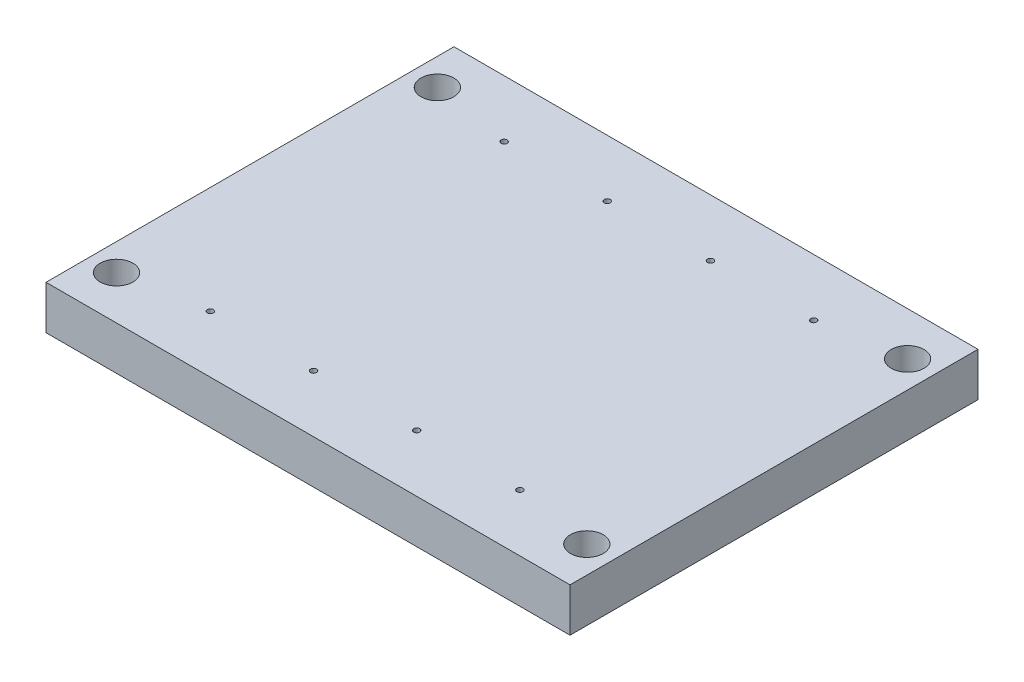
ISO-10303-21;
HEADER;
FILE_DESCRIPTION(('STEP AP214'),'2;1');
FILE_NAME('part.step','',(''),(''),'','','');
FILE_SCHEMA(('AUTOMOTIVE_DESIGN { 1 0 10303 214 1 1 1 1 }'));
ENDSEC;
DATA;
#1=APPLICATION_CONTEXT('core data for automotive mechanical design processes');
#2=APPLICATION_PROTOCOL_DEFINITION('international standard','automotive_design',2000,#1);
#3=PRODUCT_CONTEXT('',#1,'mechanical');
#4=PRODUCT('Part','Part','',(#3));
#5=PRODUCT_RELATED_PRODUCT_CATEGORY('part','',(#4));
#6=PRODUCT_DEFINITION_FORMATION('','',#4);
#7=PRODUCT_DEFINITION_CONTEXT('part definition',#1,'design');
#8=PRODUCT_DEFINITION('design','',#6,#7);
#9=PRODUCT_DEFINITION_SHAPE('','',#8);
#10=(LENGTH_UNIT() NAMED_UNIT(*) SI_UNIT(.MILLI.,.METRE.));
#11=(NAMED_UNIT(*) PLANE_ANGLE_UNIT() SI_UNIT($,.RADIAN.));
#12=(NAMED_UNIT(*) SI_UNIT($,.STERADIAN.) SOLID_ANGLE_UNIT());
#13=UNCERTAINTY_MEASURE_WITH_UNIT(LENGTH_MEASURE(1.E-05),#10,'distance_accuracy_value','');
#14=(GEOMETRIC_REPRESENTATION_CONTEXT(3) GLOBAL_UNCERTAINTY_ASSIGNED_CONTEXT((#13)) GLOBAL_UNIT_ASSIGNED_CONTEXT((#10,
#11,#12)) REPRESENTATION_CONTEXT('',''));
#15=CARTESIAN_POINT('',(0.,0.,0.));
#16=DIRECTION('',(0.,0.,1.));
#17=DIRECTION('',(1.,0.,0.));
#18=AXIS2_PLACEMENT_3D('',#15,#16,#17);
#19=CARTESIAN_POINT('',(0.,25.3999999999998,118.64219472189));
#20=DIRECTION('',(0.,0.,1.));
#21=DIRECTION('',(1.,0.,0.));
#22=AXIS2_PLACEMENT_3D('',#19,#20,#21);
#23=PLANE('',#22);
#24=DIRECTION('',(0.,1.,0.));
#25=VECTOR('',#24,1.);
#26=CARTESIAN_POINT('',(-37.9000000000013,25.3999999999998,118.64219472189));
#27=LINE('',#26,#25);
#28=CARTESIAN_POINT('',(-37.9000000000013,0.,118.64219472189));
#29=VERTEX_POINT('',#28);
#30=CARTESIAN_POINT('',(-37.9000000000013,25.3999999999998,118.64219472189));
#31=VERTEX_POINT('',#30);
#32=EDGE_CURVE('E79',#29,#31,#27,.T.);
#33=ORIENTED_EDGE('',*,*,#32,.F.);
#34=DIRECTION('',(-1.,0.,0.));
#35=VECTOR('',#34,1.);
#36=CARTESIAN_POINT('',(0.,0.,118.64219472189));
#37=LINE('',#36,#35);
#38=CARTESIAN_POINT('',(266.899999999999,0.,118.64219472189));
#39=VERTEX_POINT('',#38);
#40=EDGE_CURVE('E90',#39,#29,#37,.T.);
#41=ORIENTED_EDGE('',*,*,#40,.F.);
#42=DIRECTION('',(0.,-1.,0.));
#43=VECTOR('',#42,1.);
#44=CARTESIAN_POINT('',(266.899999999999,25.3999999999998,118.64219472189));
#45=LINE('',#44,#43);
#46=CARTESIAN_POINT('',(266.899999999999,25.3999999999998,118.64219472189));
#47=VERTEX_POINT('',#46);
#48=EDGE_CURVE('E61',#47,#39,#45,.T.);
#49=ORIENTED_EDGE('',*,*,#48,.F.);
#50=DIRECTION('',(-1.,0.,0.));
#51=VECTOR('',#50,1.);
#52=CARTESIAN_POINT('',(0.,25.3999999999998,118.64219472189));
#53=LINE('',#52,#51);
#54=EDGE_CURVE('E45',#47,#31,#53,.T.);
#55=ORIENTED_EDGE('',*,*,#54,.T.);
#56=EDGE_LOOP('',(#33,#41,#49,#55));
#57=FACE_BOUND('',#56,.T.);
#58=ADVANCED_FACE('F37',(#57),#23,.T.);
#59=CARTESIAN_POINT('',(0.,25.3999999999998,-118.64219472189));
#60=DIRECTION('',(0.,0.,-1.));
#61=DIRECTION('',(-1.,0.,0.));
#62=AXIS2_PLACEMENT_3D('',#59,#60,#61);
#63=PLANE('',#62);
#64=DIRECTION('',(0.,1.,0.));
#65=VECTOR('',#64,1.);
#66=CARTESIAN_POINT('',(-37.9000000000013,25.3999999999998,-118.64219472189));
#67=LINE('',#66,#65);
#68=CARTESIAN_POINT('',(-37.9000000000013,0.,-118.64219472189));
#69=VERTEX_POINT('',#68);
#70=CARTESIAN_POINT('',(-37.9000000000013,25.3999999999998,-118.64219472189));
#71=VERTEX_POINT('',#70);
#72=EDGE_CURVE('E53',#69,#71,#67,.T.);
#73=ORIENTED_EDGE('',*,*,#72,.T.);
#74=DIRECTION('',(1.,0.,0.));
#75=VECTOR('',#74,1.);
#76=CARTESIAN_POINT('',(0.,25.3999999999998,-118.64219472189));
#77=LINE('',#76,#75);
#78=CARTESIAN_POINT('',(266.899999999999,25.3999999999998,-118.64219472189));
#79=VERTEX_POINT('',#78);
#80=EDGE_CURVE('E11',#71,#79,#77,.T.);
#81=ORIENTED_EDGE('',*,*,#80,.T.);
#82=DIRECTION('',(0.,-1.,0.));
#83=VECTOR('',#82,1.);
#84=CARTESIAN_POINT('',(266.899999999999,25.3999999999998,-118.64219472189));
#85=LINE('',#84,#83);
#86=CARTESIAN_POINT('',(266.899999999999,0.,-118.64219472189));
#87=VERTEX_POINT('',#86);
#88=EDGE_CURVE('E173',#79,#87,#85,.T.);
#89=ORIENTED_EDGE('',*,*,#88,.T.);
#90=DIRECTION('',(1.,0.,0.));
#91=VECTOR('',#90,1.);
#92=CARTESIAN_POINT('',(0.,0.,-118.64219472189));
#93=LINE('',#92,#91);
#94=EDGE_CURVE('E40',#69,#87,#93,.T.);
#95=ORIENTED_EDGE('',*,*,#94,.F.);
#96=EDGE_LOOP('',(#73,#81,#89,#95));
#97=FACE_BOUND('',#96,.T.);
#98=ADVANCED_FACE('F179',(#97),#63,.T.);
#99=CARTESIAN_POINT('',(0.,25.3999999999998,0.));
#100=DIRECTION('',(0.,1.,0.));
#101=DIRECTION('',(0.,0.,1.));
#102=AXIS2_PLACEMENT_3D('',#99,#100,#101);
#103=PLANE('',#102);
#104=DIRECTION('',(0.,0.,1.));
#105=VECTOR('',#104,1.);
#106=CARTESIAN_POINT('',(-37.9000000000013,25.3999999999998,-118.64319472189));
#107=LINE('',#106,#105);
#108=EDGE_CURVE('E85',#71,#31,#107,.T.);
#109=ORIENTED_EDGE('',*,*,#108,.T.);
#110=ORIENTED_EDGE('',*,*,#54,.F.);
#111=DIRECTION('',(0.,0.,1.));
#112=VECTOR('',#111,1.);
#113=CARTESIAN_POINT('',(266.899999999999,25.3999999999998,-118.64319472189));
#114=LINE('',#113,#112);
#115=EDGE_CURVE('E169',#79,#47,#114,.T.);
#116=ORIENTED_EDGE('',*,*,#115,.F.);
#117=ORIENTED_EDGE('',*,*,#80,.F.);
#118=EDGE_LOOP('',(#109,#110,#116,#117));
#119=FACE_BOUND('',#118,.T.);
#120=CARTESIAN_POINT('',(-22.2546615007676,25.3999999999998,-93.3378052781097));
#121=DIRECTION('',(0.,1.,0.));
#122=DIRECTION('',(0.,0.,1.));
#123=AXIS2_PLACEMENT_3D('',#120,#121,#122);
#124=CIRCLE('',#123,9.525);
#125=CARTESIAN_POINT('',(-22.2546615007676,25.3999999999998,-83.8128052781097));
#126=VERTEX_POINT('',#125);
#127=EDGE_CURVE('E152',#126,#126,#124,.T.);
#128=ORIENTED_EDGE('',*,*,#127,.F.);
#129=EDGE_LOOP('',(#128));
#130=FACE_BOUND('',#129,.T.);
#131=CARTESIAN_POINT('',(251.254661500759,25.3999999999998,-93.3378052781097));
#132=DIRECTION('',(0.,1.,0.));
#133=DIRECTION('',(0.,0.,1.));
#134=AXIS2_PLACEMENT_3D('',#131,#132,#133);
#135=CIRCLE('',#134,9.52500000000002);
#136=CARTESIAN_POINT('',(251.254661500759,25.3999999999998,-83.8128052781097));
#137=VERTEX_POINT('',#136);
#138=EDGE_CURVE('E158',#137,#137,#135,.T.);
#139=ORIENTED_EDGE('',*,*,#138,.F.);
#140=EDGE_LOOP('',(#139));
#141=FACE_BOUND('',#140,.T.);
#142=CARTESIAN_POINT('',(251.254661500759,25.3999999999998,93.2421947218903));
#143=DIRECTION('',(0.,1.,0.));
#144=DIRECTION('',(0.,0.,1.));
#145=AXIS2_PLACEMENT_3D('',#142,#143,#144);
#146=CIRCLE('',#145,9.52500000000002);
#147=CARTESIAN_POINT('',(251.254661500759,25.3999999999998,102.76719472189));
#148=VERTEX_POINT('',#147);
#149=EDGE_CURVE('E164',#148,#148,#146,.T.);
#150=ORIENTED_EDGE('',*,*,#149,.F.);
#151=EDGE_LOOP('',(#150));
#152=FACE_BOUND('',#151,.T.);
#153=CARTESIAN_POINT('',(-22.2546615007676,25.3999999999998,93.2421947218903));
#154=DIRECTION('',(0.,1.,0.));
#155=DIRECTION('',(0.,0.,1.));
#156=AXIS2_PLACEMENT_3D('',#153,#154,#155);
#157=CIRCLE('',#156,9.525);
#158=CARTESIAN_POINT('',(-22.2546615007676,25.3999999999998,102.76719472189));
#159=VERTEX_POINT('',#158);
#160=EDGE_CURVE('E146',#159,#159,#157,.T.);
#161=ORIENTED_EDGE('',*,*,#160,.F.);
#162=EDGE_LOOP('',(#161));
#163=FACE_BOUND('',#162,.T.);
#164=CARTESIAN_POINT('',(24.4999999999974,25.3999999999998,85.4421947218903));
#165=DIRECTION('',(0.,1.,0.));
#166=DIRECTION('',(0.,0.,1.));
#167=AXIS2_PLACEMENT_3D('',#164,#165,#166);
#168=CIRCLE('',#167,1.75000000000001);
#169=CARTESIAN_POINT('',(24.4999999999974,25.3999999999998,87.1921947218903));
#170=VERTEX_POINT('',#169);
#171=EDGE_CURVE('E116',#170,#170,#168,.T.);
#172=ORIENTED_EDGE('',*,*,#171,.F.);
#173=EDGE_LOOP('',(#172));
#174=FACE_BOUND('',#173,.T.);
#175=CARTESIAN_POINT('',(204.499999999997,25.3999999999998,-85.4421947218902));
#176=DIRECTION('',(0.,1.,0.));
#177=DIRECTION('',(0.,0.,1.));
#178=AXIS2_PLACEMENT_3D('',#175,#176,#177);
#179=CIRCLE('',#178,1.75000000000001);
#180=CARTESIAN_POINT('',(204.499999999997,25.3999999999998,-83.6921947218902));
#181=VERTEX_POINT('',#180);
#182=EDGE_CURVE('E123',#181,#181,#179,.T.);
#183=ORIENTED_EDGE('',*,*,#182,.F.);
#184=EDGE_LOOP('',(#183));
#185=FACE_BOUND('',#184,.T.);
#186=CARTESIAN_POINT('',(144.499999999997,25.3999999999998,-85.4421947218902));
#187=DIRECTION('',(0.,1.,0.));
#188=DIRECTION('',(0.,0.,1.));
#189=AXIS2_PLACEMENT_3D('',#186,#187,#188);
#190=CIRCLE('',#189,1.75000000000001);
#191=CARTESIAN_POINT('',(144.499999999997,25.3999999999998,-83.6921947218902));
#192=VERTEX_POINT('',#191);
#193=EDGE_CURVE('E104',#192,#192,#190,.T.);
#194=ORIENTED_EDGE('',*,*,#193,.F.);
#195=EDGE_LOOP('',(#194));
#196=FACE_BOUND('',#195,.T.);
#197=CARTESIAN_POINT('',(84.4999999999974,25.3999999999998,-85.4421947218902));
#198=DIRECTION('',(0.,1.,0.));
#199=DIRECTION('',(0.,0.,1.));
#200=AXIS2_PLACEMENT_3D('',#197,#198,#199);
#201=CIRCLE('',#200,1.75);
#202=CARTESIAN_POINT('',(84.4999999999974,25.3999999999998,-83.6921947218902));
#203=VERTEX_POINT('',#202);
#204=EDGE_CURVE('E111',#203,#203,#201,.T.);
#205=ORIENTED_EDGE('',*,*,#204,.F.);
#206=EDGE_LOOP('',(#205));
#207=FACE_BOUND('',#206,.T.);
#208=CARTESIAN_POINT('',(84.4999999999974,25.3999999999998,85.4421947218903));
#209=DIRECTION('',(0.,1.,0.));
#210=DIRECTION('',(0.,0.,1.));
#211=AXIS2_PLACEMENT_3D('',#208,#209,#210);
#212=CIRCLE('',#211,1.75);
#213=CARTESIAN_POINT('',(84.4999999999974,25.3999999999998,87.1921947218903));
#214=VERTEX_POINT('',#213);
#215=EDGE_CURVE('E141',#214,#214,#212,.T.);
#216=ORIENTED_EDGE('',*,*,#215,.F.);
#217=EDGE_LOOP('',(#216));
#218=FACE_BOUND('',#217,.T.);
#219=CARTESIAN_POINT('',(144.499999999997,25.3999999999998,85.4421947218903));
#220=DIRECTION('',(0.,1.,0.));
#221=DIRECTION('',(0.,0.,1.));
#222=AXIS2_PLACEMENT_3D('',#219,#220,#221);
#223=CIRCLE('',#222,1.75000000000001);
#224=CARTESIAN_POINT('',(144.499999999997,25.3999999999998,87.1921947218903));
#225=VERTEX_POINT('',#224);
#226=EDGE_CURVE('E135',#225,#225,#223,.T.);
#227=ORIENTED_EDGE('',*,*,#226,.F.);
#228=EDGE_LOOP('',(#227));
#229=FACE_BOUND('',#228,.T.);
#230=CARTESIAN_POINT('',(204.499999999997,25.3999999999998,85.4421947218903));
#231=DIRECTION('',(0.,1.,0.));
#232=DIRECTION('',(0.,0.,1.));
#233=AXIS2_PLACEMENT_3D('',#230,#231,#232);
#234=CIRCLE('',#233,1.75000000000001);
#235=CARTESIAN_POINT('',(204.499999999997,25.3999999999998,87.1921947218904));
#236=VERTEX_POINT('',#235);
#237=EDGE_CURVE('E128',#236,#236,#234,.T.);
#238=ORIENTED_EDGE('',*,*,#237,.F.);
#239=EDGE_LOOP('',(#238));
#240=FACE_BOUND('',#239,.T.);
#241=CARTESIAN_POINT('',(24.4999999999974,25.3999999999998,-85.4421947218903));
#242=DIRECTION('',(0.,1.,0.));
#243=DIRECTION('',(0.,0.,1.));
#244=AXIS2_PLACEMENT_3D('',#241,#242,#243);
#245=CIRCLE('',#244,1.75000000000001);
#246=CARTESIAN_POINT('',(24.4999999999974,25.3999999999998,-83.6921947218903));
#247=VERTEX_POINT('',#246);
#248=EDGE_CURVE('E97',#247,#247,#245,.T.);
#249=ORIENTED_EDGE('',*,*,#248,.F.);
#250=EDGE_LOOP('',(#249));
#251=FACE_BOUND('',#250,.T.);
#252=ADVANCED_FACE('F182',(#119,#130,#141,#152,#163,#174,#185,#196,#207,#218,#229,#240,#251),
#103,.T.);
#253=CARTESIAN_POINT('',(0.,0.,0.));
#254=DIRECTION('',(0.,1.,0.));
#255=DIRECTION('',(0.,0.,1.));
#256=AXIS2_PLACEMENT_3D('',#253,#254,#255);
#257=PLANE('',#256);
#258=CARTESIAN_POINT('',(-22.2546615007676,0.,-93.3378052781097));
#259=DIRECTION('',(0.,1.,0.));
#260=DIRECTION('',(0.,0.,1.));
#261=AXIS2_PLACEMENT_3D('',#258,#259,#260);
#262=CIRCLE('',#261,9.525);
#263=CARTESIAN_POINT('',(-22.2546615007676,0.,-83.8128052781097));
#264=VERTEX_POINT('',#263);
#265=EDGE_CURVE('E155',#264,#264,#262,.T.);
#266=ORIENTED_EDGE('',*,*,#265,.T.);
#267=EDGE_LOOP('',(#266));
#268=FACE_BOUND('',#267,.T.);
#269=CARTESIAN_POINT('',(251.254661500759,0.,-93.3378052781097));
#270=DIRECTION('',(0.,1.,0.));
#271=DIRECTION('',(0.,0.,1.));
#272=AXIS2_PLACEMENT_3D('',#269,#270,#271);
#273=CIRCLE('',#272,9.52500000000002);
#274=CARTESIAN_POINT('',(251.254661500759,0.,-83.8128052781097));
#275=VERTEX_POINT('',#274);
#276=EDGE_CURVE('E161',#275,#275,#273,.T.);
#277=ORIENTED_EDGE('',*,*,#276,.T.);
#278=EDGE_LOOP('',(#277));
#279=FACE_BOUND('',#278,.T.);
#280=CARTESIAN_POINT('',(251.254661500759,0.,93.2421947218903));
#281=DIRECTION('',(0.,1.,0.));
#282=DIRECTION('',(0.,0.,1.));
#283=AXIS2_PLACEMENT_3D('',#280,#281,#282);
#284=CIRCLE('',#283,9.52500000000002);
#285=CARTESIAN_POINT('',(251.254661500759,0.,102.76719472189));
#286=VERTEX_POINT('',#285);
#287=EDGE_CURVE('E149',#286,#286,#284,.T.);
#288=ORIENTED_EDGE('',*,*,#287,.T.);
#289=EDGE_LOOP('',(#288));
#290=FACE_BOUND('',#289,.T.);
#291=CARTESIAN_POINT('',(-22.2546615007676,0.,93.2421947218903));
#292=DIRECTION('',(0.,1.,0.));
#293=DIRECTION('',(0.,0.,1.));
#294=AXIS2_PLACEMENT_3D('',#291,#292,#293);
#295=CIRCLE('',#294,9.525);
#296=CARTESIAN_POINT('',(-22.2546615007676,0.,102.76719472189));
#297=VERTEX_POINT('',#296);
#298=EDGE_CURVE('E132',#297,#297,#295,.T.);
#299=ORIENTED_EDGE('',*,*,#298,.T.);
#300=EDGE_LOOP('',(#299));
#301=FACE_BOUND('',#300,.T.);
#302=ORIENTED_EDGE('',*,*,#40,.T.);
#303=DIRECTION('',(0.,0.,1.));
#304=VECTOR('',#303,1.);
#305=CARTESIAN_POINT('',(-37.9000000000013,0.,-118.64319472189));
#306=LINE('',#305,#304);
#307=EDGE_CURVE('E76',#69,#29,#306,.T.);
#308=ORIENTED_EDGE('',*,*,#307,.F.);
#309=ORIENTED_EDGE('',*,*,#94,.T.);
#310=DIRECTION('',(0.,0.,1.));
#311=VECTOR('',#310,1.);
#312=CARTESIAN_POINT('',(266.899999999999,0.,-118.64319472189));
#313=LINE('',#312,#311);
#314=EDGE_CURVE('E94',#87,#39,#313,.T.);
#315=ORIENTED_EDGE('',*,*,#314,.T.);
#316=EDGE_LOOP('',(#302,#308,#309,#315));
#317=FACE_BOUND('',#316,.T.);
#318=ADVANCED_FACE('F93',(#268,#279,#290,#301,#317),#257,.F.);
#319=CARTESIAN_POINT('',(24.4999999999974,19.0499999999998,-85.4421947218903));
#320=DIRECTION('',(0.,1.,0.));
#321=DIRECTION('',(0.,0.,1.));
#322=AXIS2_PLACEMENT_3D('',#319,#320,#321);
#323=CYLINDRICAL_SURFACE('',#322,1.75000000000001);
#324=CARTESIAN_POINT('',(24.4999999999974,19.0499999999998,-85.4421947218903));
#325=DIRECTION('',(0.,1.,0.));
#326=DIRECTION('',(0.,0.,1.));
#327=AXIS2_PLACEMENT_3D('',#324,#325,#326);
#328=CIRCLE('',#327,1.75000000000001);
#329=CARTESIAN_POINT('',(24.4999999999974,19.0499999999998,-83.6921947218903));
#330=VERTEX_POINT('',#329);
#331=EDGE_CURVE('E95',#330,#330,#328,.T.);
#332=ORIENTED_EDGE('',*,*,#331,.F.);
#333=EDGE_LOOP('',(#332));
#334=FACE_BOUND('',#333,.T.);
#335=ORIENTED_EDGE('',*,*,#248,.T.);
#336=EDGE_LOOP('',(#335));
#337=FACE_BOUND('',#336,.T.);
#338=ADVANCED_FACE('F207',(#334,#337),#323,.F.);
#339=CARTESIAN_POINT('',(24.4999999999974,19.0499999999998,-85.4421947218903));
#340=DIRECTION('',(0.,1.,0.));
#341=DIRECTION('',(0.,0.,1.));
#342=AXIS2_PLACEMENT_3D('',#339,#340,#341);
#343=PLANE('',#342);
#344=ORIENTED_EDGE('',*,*,#331,.T.);
#345=EDGE_LOOP('',(#344));
#346=FACE_BOUND('',#345,.T.);
#347=ADVANCED_FACE('F212',(#346),#343,.T.);
#348=CARTESIAN_POINT('',(204.499999999997,19.0499999999998,85.4421947218903));
#349=DIRECTION('',(0.,1.,0.));
#350=DIRECTION('',(0.,0.,1.));
#351=AXIS2_PLACEMENT_3D('',#348,#349,#350);
#352=CYLINDRICAL_SURFACE('',#351,1.75000000000001);
#353=CARTESIAN_POINT('',(204.499999999997,19.0499999999998,85.4421947218903));
#354=DIRECTION('',(0.,1.,0.));
#355=DIRECTION('',(0.,0.,1.));
#356=AXIS2_PLACEMENT_3D('',#353,#354,#355);
#357=CIRCLE('',#356,1.75000000000001);
#358=CARTESIAN_POINT('',(204.499999999997,19.0499999999998,87.1921947218904));
#359=VERTEX_POINT('',#358);
#360=EDGE_CURVE('E131',#359,#359,#357,.T.);
#361=ORIENTED_EDGE('',*,*,#360,.F.);
#362=EDGE_LOOP('',(#361));
#363=FACE_BOUND('',#362,.T.);
#364=ORIENTED_EDGE('',*,*,#237,.T.);
#365=EDGE_LOOP('',(#364));
#366=FACE_BOUND('',#365,.T.);
#367=ADVANCED_FACE('F216',(#363,#366),#352,.F.);
#368=CARTESIAN_POINT('',(204.499999999997,19.0499999999998,85.4421947218903));
#369=DIRECTION('',(0.,1.,0.));
#370=DIRECTION('',(0.,0.,1.));
#371=AXIS2_PLACEMENT_3D('',#368,#369,#370);
#372=PLANE('',#371);
#373=ORIENTED_EDGE('',*,*,#360,.T.);
#374=EDGE_LOOP('',(#373));
#375=FACE_BOUND('',#374,.T.);
#376=ADVANCED_FACE('F254',(#375),#372,.T.);
#377=CARTESIAN_POINT('',(144.499999999997,19.0499999999998,85.4421947218903));
#378=DIRECTION('',(0.,1.,0.));
#379=DIRECTION('',(0.,0.,1.));
#380=AXIS2_PLACEMENT_3D('',#377,#378,#379);
#381=CYLINDRICAL_SURFACE('',#380,1.75000000000001);
#382=CARTESIAN_POINT('',(144.499999999997,19.0499999999998,85.4421947218903));
#383=DIRECTION('',(0.,1.,0.));
#384=DIRECTION('',(0.,0.,1.));
#385=AXIS2_PLACEMENT_3D('',#382,#383,#384);
#386=CIRCLE('',#385,1.75000000000001);
#387=CARTESIAN_POINT('',(144.499999999997,19.0499999999998,87.1921947218903));
#388=VERTEX_POINT('',#387);
#389=EDGE_CURVE('E138',#388,#388,#386,.T.);
#390=ORIENTED_EDGE('',*,*,#389,.F.);
#391=EDGE_LOOP('',(#390));
#392=FACE_BOUND('',#391,.T.);
#393=ORIENTED_EDGE('',*,*,#226,.T.);
#394=EDGE_LOOP('',(#393));
#395=FACE_BOUND('',#394,.T.);
#396=ADVANCED_FACE('F258',(#392,#395),#381,.F.);
#397=CARTESIAN_POINT('',(144.499999999997,19.0499999999998,85.4421947218903));
#398=DIRECTION('',(0.,1.,0.));
#399=DIRECTION('',(0.,0.,1.));
#400=AXIS2_PLACEMENT_3D('',#397,#398,#399);
#401=PLANE('',#400);
#402=ORIENTED_EDGE('',*,*,#389,.T.);
#403=EDGE_LOOP('',(#402));
#404=FACE_BOUND('',#403,.T.);
#405=ADVANCED_FACE('F262',(#404),#401,.T.);
#406=CARTESIAN_POINT('',(84.4999999999974,19.0499999999998,85.4421947218903));
#407=DIRECTION('',(0.,1.,0.));
#408=DIRECTION('',(0.,0.,1.));
#409=AXIS2_PLACEMENT_3D('',#406,#407,#408);
#410=CYLINDRICAL_SURFACE('',#409,1.75);
#411=CARTESIAN_POINT('',(84.4999999999974,19.0499999999998,85.4421947218903));
#412=DIRECTION('',(0.,1.,0.));
#413=DIRECTION('',(0.,0.,1.));
#414=AXIS2_PLACEMENT_3D('',#411,#412,#413);
#415=CIRCLE('',#414,1.75);
#416=CARTESIAN_POINT('',(84.4999999999974,19.0499999999998,87.1921947218903));
#417=VERTEX_POINT('',#416);
#418=EDGE_CURVE('E120',#417,#417,#415,.T.);
#419=ORIENTED_EDGE('',*,*,#418,.F.);
#420=EDGE_LOOP('',(#419));
#421=FACE_BOUND('',#420,.T.);
#422=ORIENTED_EDGE('',*,*,#215,.T.);
#423=EDGE_LOOP('',(#422));
#424=FACE_BOUND('',#423,.T.);
#425=ADVANCED_FACE('F266',(#421,#424),#410,.F.);
#426=CARTESIAN_POINT('',(84.4999999999974,19.0499999999998,85.4421947218903));
#427=DIRECTION('',(0.,1.,0.));
#428=DIRECTION('',(0.,0.,1.));
#429=AXIS2_PLACEMENT_3D('',#426,#427,#428);
#430=PLANE('',#429);
#431=ORIENTED_EDGE('',*,*,#418,.T.);
#432=EDGE_LOOP('',(#431));
#433=FACE_BOUND('',#432,.T.);
#434=ADVANCED_FACE('F231',(#433),#430,.T.);
#435=CARTESIAN_POINT('',(84.4999999999974,19.0499999999998,-85.4421947218902));
#436=DIRECTION('',(0.,1.,0.));
#437=DIRECTION('',(0.,0.,1.));
#438=AXIS2_PLACEMENT_3D('',#435,#436,#437);
#439=CYLINDRICAL_SURFACE('',#438,1.75);
#440=CARTESIAN_POINT('',(84.4999999999974,19.0499999999998,-85.4421947218902));
#441=DIRECTION('',(0.,1.,0.));
#442=DIRECTION('',(0.,0.,1.));
#443=AXIS2_PLACEMENT_3D('',#440,#441,#442);
#444=CIRCLE('',#443,1.75);
#445=CARTESIAN_POINT('',(84.4999999999974,19.0499999999998,-83.6921947218902));
#446=VERTEX_POINT('',#445);
#447=EDGE_CURVE('E102',#446,#446,#444,.T.);
#448=ORIENTED_EDGE('',*,*,#447,.F.);
#449=EDGE_LOOP('',(#448));
#450=FACE_BOUND('',#449,.T.);
#451=ORIENTED_EDGE('',*,*,#204,.T.);
#452=EDGE_LOOP('',(#451));
#453=FACE_BOUND('',#452,.T.);
#454=ADVANCED_FACE('F228',(#450,#453),#439,.F.);
#455=CARTESIAN_POINT('',(84.4999999999974,19.0499999999998,-85.4421947218902));
#456=DIRECTION('',(0.,1.,0.));
#457=DIRECTION('',(0.,0.,1.));
#458=AXIS2_PLACEMENT_3D('',#455,#456,#457);
#459=PLANE('',#458);
#460=ORIENTED_EDGE('',*,*,#447,.T.);
#461=EDGE_LOOP('',(#460));
#462=FACE_BOUND('',#461,.T.);
#463=ADVANCED_FACE('F222',(#462),#459,.T.);
#464=CARTESIAN_POINT('',(144.499999999997,19.0499999999998,-85.4421947218902));
#465=DIRECTION('',(0.,1.,0.));
#466=DIRECTION('',(0.,0.,1.));
#467=AXIS2_PLACEMENT_3D('',#464,#465,#466);
#468=CYLINDRICAL_SURFACE('',#467,1.75000000000001);
#469=CARTESIAN_POINT('',(144.499999999997,19.0499999999998,-85.4421947218902));
#470=DIRECTION('',(0.,1.,0.));
#471=DIRECTION('',(0.,0.,1.));
#472=AXIS2_PLACEMENT_3D('',#469,#470,#471);
#473=CIRCLE('',#472,1.75000000000001);
#474=CARTESIAN_POINT('',(144.499999999997,19.0499999999998,-83.6921947218902));
#475=VERTEX_POINT('',#474);
#476=EDGE_CURVE('E107',#475,#475,#473,.T.);
#477=ORIENTED_EDGE('',*,*,#476,.F.);
#478=EDGE_LOOP('',(#477));
#479=FACE_BOUND('',#478,.T.);
#480=ORIENTED_EDGE('',*,*,#193,.T.);
#481=EDGE_LOOP('',(#480));
#482=FACE_BOUND('',#481,.T.);
#483=ADVANCED_FACE('F218',(#479,#482),#468,.F.);
#484=CARTESIAN_POINT('',(144.499999999997,19.0499999999998,-85.4421947218902));
#485=DIRECTION('',(0.,1.,0.));
#486=DIRECTION('',(0.,0.,1.));
#487=AXIS2_PLACEMENT_3D('',#484,#485,#486);
#488=PLANE('',#487);
#489=ORIENTED_EDGE('',*,*,#476,.T.);
#490=EDGE_LOOP('',(#489));
#491=FACE_BOUND('',#490,.T.);
#492=ADVANCED_FACE('F221',(#491),#488,.T.);
#493=CARTESIAN_POINT('',(204.499999999997,19.0499999999998,-85.4421947218902));
#494=DIRECTION('',(0.,1.,0.));
#495=DIRECTION('',(0.,0.,1.));
#496=AXIS2_PLACEMENT_3D('',#493,#494,#495);
#497=CYLINDRICAL_SURFACE('',#496,1.75000000000001);
#498=CARTESIAN_POINT('',(204.499999999997,19.0499999999998,-85.4421947218902));
#499=DIRECTION('',(0.,1.,0.));
#500=DIRECTION('',(0.,0.,1.));
#501=AXIS2_PLACEMENT_3D('',#498,#499,#500);
#502=CIRCLE('',#501,1.75000000000001);
#503=CARTESIAN_POINT('',(204.499999999997,19.0499999999998,-83.6921947218902));
#504=VERTEX_POINT('',#503);
#505=EDGE_CURVE('E108',#504,#504,#502,.T.);
#506=ORIENTED_EDGE('',*,*,#505,.F.);
#507=EDGE_LOOP('',(#506));
#508=FACE_BOUND('',#507,.T.);
#509=ORIENTED_EDGE('',*,*,#182,.T.);
#510=EDGE_LOOP('',(#509));
#511=FACE_BOUND('',#510,.T.);
#512=ADVANCED_FACE('F226',(#508,#511),#497,.F.);
#513=CARTESIAN_POINT('',(204.499999999997,19.0499999999998,-85.4421947218902));
#514=DIRECTION('',(0.,1.,0.));
#515=DIRECTION('',(0.,0.,1.));
#516=AXIS2_PLACEMENT_3D('',#513,#514,#515);
#517=PLANE('',#516);
#518=ORIENTED_EDGE('',*,*,#505,.T.);
#519=EDGE_LOOP('',(#518));
#520=FACE_BOUND('',#519,.T.);
#521=ADVANCED_FACE('F240',(#520),#517,.T.);
#522=CARTESIAN_POINT('',(24.4999999999974,19.0499999999998,85.4421947218903));
#523=DIRECTION('',(0.,1.,0.));
#524=DIRECTION('',(0.,0.,1.));
#525=AXIS2_PLACEMENT_3D('',#522,#523,#524);
#526=CYLINDRICAL_SURFACE('',#525,1.75000000000001);
#527=CARTESIAN_POINT('',(24.4999999999974,19.0499999999998,85.4421947218903));
#528=DIRECTION('',(0.,1.,0.));
#529=DIRECTION('',(0.,0.,1.));
#530=AXIS2_PLACEMENT_3D('',#527,#528,#529);
#531=CIRCLE('',#530,1.75000000000001);
#532=CARTESIAN_POINT('',(24.4999999999974,19.0499999999998,87.1921947218903));
#533=VERTEX_POINT('',#532);
#534=EDGE_CURVE('E119',#533,#533,#531,.T.);
#535=ORIENTED_EDGE('',*,*,#534,.F.);
#536=EDGE_LOOP('',(#535));
#537=FACE_BOUND('',#536,.T.);
#538=ORIENTED_EDGE('',*,*,#171,.T.);
#539=EDGE_LOOP('',(#538));
#540=FACE_BOUND('',#539,.T.);
#541=ADVANCED_FACE('F236',(#537,#540),#526,.F.);
#542=CARTESIAN_POINT('',(24.4999999999974,19.0499999999998,85.4421947218903));
#543=DIRECTION('',(0.,1.,0.));
#544=DIRECTION('',(0.,0.,1.));
#545=AXIS2_PLACEMENT_3D('',#542,#543,#544);
#546=PLANE('',#545);
#547=ORIENTED_EDGE('',*,*,#534,.T.);
#548=EDGE_LOOP('',(#547));
#549=FACE_BOUND('',#548,.T.);
#550=ADVANCED_FACE('F239',(#549),#546,.T.);
#551=CARTESIAN_POINT('',(-22.2546615007676,0.,93.2421947218903));
#552=DIRECTION('',(0.,1.,0.));
#553=DIRECTION('',(0.,0.,1.));
#554=AXIS2_PLACEMENT_3D('',#551,#552,#553);
#555=CYLINDRICAL_SURFACE('',#554,9.525);
#556=ORIENTED_EDGE('',*,*,#298,.F.);
#557=EDGE_LOOP('',(#556));
#558=FACE_BOUND('',#557,.T.);
#559=ORIENTED_EDGE('',*,*,#160,.T.);
#560=EDGE_LOOP('',(#559));
#561=FACE_BOUND('',#560,.T.);
#562=ADVANCED_FACE('F244',(#558,#561),#555,.F.);
#563=CARTESIAN_POINT('',(251.254661500759,0.,93.2421947218903));
#564=DIRECTION('',(0.,1.,0.));
#565=DIRECTION('',(0.,0.,1.));
#566=AXIS2_PLACEMENT_3D('',#563,#564,#565);
#567=CYLINDRICAL_SURFACE('',#566,9.52500000000002);
#568=ORIENTED_EDGE('',*,*,#287,.F.);
#569=EDGE_LOOP('',(#568));
#570=FACE_BOUND('',#569,.T.);
#571=ORIENTED_EDGE('',*,*,#149,.T.);
#572=EDGE_LOOP('',(#571));
#573=FACE_BOUND('',#572,.T.);
#574=ADVANCED_FACE('F275',(#570,#573),#567,.F.);
#575=CARTESIAN_POINT('',(251.254661500759,0.,-93.3378052781097));
#576=DIRECTION('',(0.,1.,0.));
#577=DIRECTION('',(0.,0.,1.));
#578=AXIS2_PLACEMENT_3D('',#575,#576,#577);
#579=CYLINDRICAL_SURFACE('',#578,9.52500000000002);
#580=ORIENTED_EDGE('',*,*,#276,.F.);
#581=EDGE_LOOP('',(#580));
#582=FACE_BOUND('',#581,.T.);
#583=ORIENTED_EDGE('',*,*,#138,.T.);
#584=EDGE_LOOP('',(#583));
#585=FACE_BOUND('',#584,.T.);
#586=ADVANCED_FACE('F193',(#582,#585),#579,.F.);
#587=CARTESIAN_POINT('',(-22.2546615007676,0.,-93.3378052781097));
#588=DIRECTION('',(0.,1.,0.));
#589=DIRECTION('',(0.,0.,1.));
#590=AXIS2_PLACEMENT_3D('',#587,#588,#589);
#591=CYLINDRICAL_SURFACE('',#590,9.525);
#592=ORIENTED_EDGE('',*,*,#265,.F.);
#593=EDGE_LOOP('',(#592));
#594=FACE_BOUND('',#593,.T.);
#595=ORIENTED_EDGE('',*,*,#127,.T.);
#596=EDGE_LOOP('',(#595));
#597=FACE_BOUND('',#596,.T.);
#598=ADVANCED_FACE('F186',(#594,#597),#591,.F.);
#599=CARTESIAN_POINT('',(266.899999999999,25.3999999999998,-118.64319472189));
#600=DIRECTION('',(-1.,0.,0.));
#601=DIRECTION('',(0.,0.,1.));
#602=AXIS2_PLACEMENT_3D('',#599,#600,#601);
#603=PLANE('',#602);
#604=ORIENTED_EDGE('',*,*,#115,.T.);
#605=ORIENTED_EDGE('',*,*,#48,.T.);
#606=ORIENTED_EDGE('',*,*,#314,.F.);
#607=ORIENTED_EDGE('',*,*,#88,.F.);
#608=EDGE_LOOP('',(#604,#605,#606,#607));
#609=FACE_BOUND('',#608,.T.);
#610=ADVANCED_FACE('F184',(#609),#603,.F.);
#611=CARTESIAN_POINT('',(-37.9000000000013,25.3999999999998,-118.64319472189));
#612=DIRECTION('',(1.,0.,0.));
#613=DIRECTION('',(0.,0.,-1.));
#614=AXIS2_PLACEMENT_3D('',#611,#612,#613);
#615=PLANE('',#614);
#616=ORIENTED_EDGE('',*,*,#307,.T.);
#617=ORIENTED_EDGE('',*,*,#32,.T.);
#618=ORIENTED_EDGE('',*,*,#108,.F.);
#619=ORIENTED_EDGE('',*,*,#72,.F.);
#620=EDGE_LOOP('',(#616,#617,#618,#619));
#621=FACE_BOUND('',#620,.T.);
#622=ADVANCED_FACE('F78',(#621),#615,.F.);
#623=CLOSED_SHELL('',(#58,#98,#252,#318,#338,#347,#367,#376,#396,#405,#425,#434,#454,#463,#483,
#492,#512,#521,#541,#550,#562,#574,#586,#598,#610,#622));
#624=MANIFOLD_SOLID_BREP('B2',#623);
#625=ADVANCED_BREP_SHAPE_REPRESENTATION('',(#18,#624),#14);
#626=SHAPE_DEFINITION_REPRESENTATION(#9,#625);
ENDSEC;
END-ISO-10303-21;
